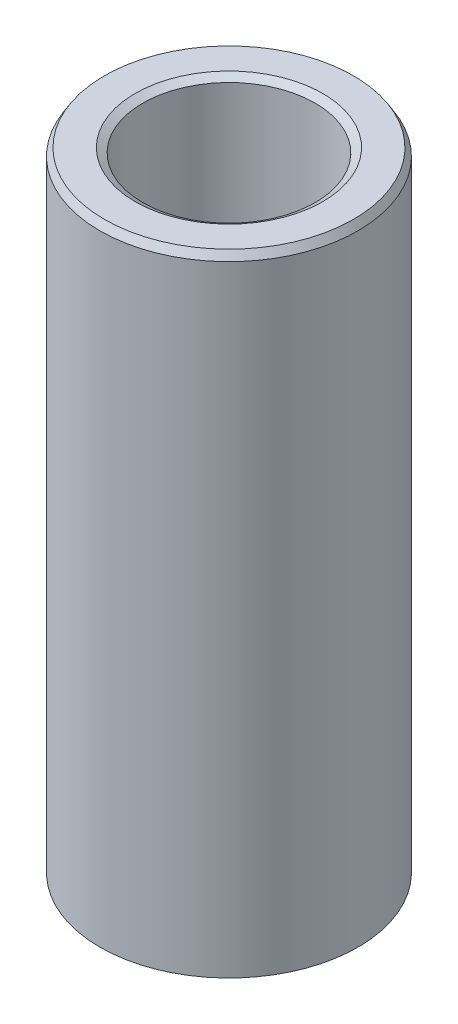
ISO-10303-21;
HEADER;
FILE_DESCRIPTION(('STEP AP214'),'2;1');
FILE_NAME('part.step','',(''),(''),'','','');
FILE_SCHEMA(('AUTOMOTIVE_DESIGN { 1 0 10303 214 1 1 1 1 }'));
ENDSEC;
DATA;
#1=APPLICATION_CONTEXT('core data for automotive mechanical design processes');
#2=APPLICATION_PROTOCOL_DEFINITION('international standard','automotive_design',2000,#1);
#3=PRODUCT_CONTEXT('',#1,'mechanical');
#4=PRODUCT('Part','Part','',(#3));
#5=PRODUCT_RELATED_PRODUCT_CATEGORY('part','',(#4));
#6=PRODUCT_DEFINITION_FORMATION('','',#4);
#7=PRODUCT_DEFINITION_CONTEXT('part definition',#1,'design');
#8=PRODUCT_DEFINITION('design','',#6,#7);
#9=PRODUCT_DEFINITION_SHAPE('','',#8);
#10=(LENGTH_UNIT() NAMED_UNIT(*) SI_UNIT(.MILLI.,.METRE.));
#11=(NAMED_UNIT(*) PLANE_ANGLE_UNIT() SI_UNIT($,.RADIAN.));
#12=(NAMED_UNIT(*) SI_UNIT($,.STERADIAN.) SOLID_ANGLE_UNIT());
#13=UNCERTAINTY_MEASURE_WITH_UNIT(LENGTH_MEASURE(1.E-05),#10,'distance_accuracy_value','');
#14=(GEOMETRIC_REPRESENTATION_CONTEXT(3) GLOBAL_UNCERTAINTY_ASSIGNED_CONTEXT((#13)) GLOBAL_UNIT_ASSIGNED_CONTEXT((#10,
#11,#12)) REPRESENTATION_CONTEXT('',''));
#15=CARTESIAN_POINT('',(0.,0.,0.));
#16=DIRECTION('',(0.,0.,1.));
#17=DIRECTION('',(1.,0.,0.));
#18=AXIS2_PLACEMENT_3D('',#15,#16,#17);
#19=CARTESIAN_POINT('',(0.,294.108973790896,0.));
#20=DIRECTION('',(0.,-1.,0.));
#21=DIRECTION('',(0.,0.,-1.));
#22=AXIS2_PLACEMENT_3D('',#19,#20,#21);
#23=CYLINDRICAL_SURFACE('',#22,60.);
#24=CARTESIAN_POINT('',(0.,2.12950079022189,0.));
#25=DIRECTION('',(0.,1.,0.));
#26=DIRECTION('',(0.,0.,1.));
#27=AXIS2_PLACEMENT_3D('',#24,#25,#26);
#28=CIRCLE('',#27,60.);
#29=CARTESIAN_POINT('',(0.,2.12950079022189,60.));
#30=VERTEX_POINT('',#29);
#31=EDGE_CURVE('E10',#30,#30,#28,.T.);
#32=ORIENTED_EDGE('',*,*,#31,.T.);
#33=EDGE_LOOP('',(#32));
#34=FACE_BOUND('',#33,.T.);
#35=CARTESIAN_POINT('',(0.,290.582787884817,0.));
#36=DIRECTION('',(0.,1.,0.));
#37=DIRECTION('',(0.,0.,1.));
#38=AXIS2_PLACEMENT_3D('',#35,#36,#37);
#39=CIRCLE('',#38,60.);
#40=CARTESIAN_POINT('',(0.,290.582787884817,60.));
#41=VERTEX_POINT('',#40);
#42=EDGE_CURVE('E50',#41,#41,#39,.F.);
#43=ORIENTED_EDGE('',*,*,#42,.T.);
#44=EDGE_LOOP('',(#43));
#45=FACE_BOUND('',#44,.T.);
#46=ADVANCED_FACE('F39',(#34,#45),#23,.T.);
#47=CARTESIAN_POINT('',(0.,294.108973790896,0.));
#48=DIRECTION('',(0.,1.,0.));
#49=DIRECTION('',(0.,0.,1.));
#50=AXIS2_PLACEMENT_3D('',#47,#48,#49);
#51=PLANE('',#50);
#52=CARTESIAN_POINT('',(0.,294.108973790896,0.));
#53=DIRECTION('',(0.,1.,0.));
#54=DIRECTION('',(0.,0.,1.));
#55=AXIS2_PLACEMENT_3D('',#52,#53,#54);
#56=CIRCLE('',#55,43.6024586582773);
#57=CARTESIAN_POINT('',(0.,294.108973790896,43.6024586582773));
#58=VERTEX_POINT('',#57);
#59=EDGE_CURVE('E58',#58,#58,#56,.F.);
#60=ORIENTED_EDGE('',*,*,#59,.T.);
#61=EDGE_LOOP('',(#60));
#62=FACE_BOUND('',#61,.T.);
#63=CARTESIAN_POINT('',(0.,294.108973790896,0.));
#64=DIRECTION('',(0.,1.,0.));
#65=DIRECTION('',(0.,0.,1.));
#66=AXIS2_PLACEMENT_3D('',#63,#64,#65);
#67=CIRCLE('',#66,57.8704992097781);
#68=CARTESIAN_POINT('',(0.,294.108973790896,57.8704992097781));
#69=VERTEX_POINT('',#68);
#70=EDGE_CURVE('E61',#69,#69,#67,.T.);
#71=ORIENTED_EDGE('',*,*,#70,.T.);
#72=EDGE_LOOP('',(#71));
#73=FACE_BOUND('',#72,.T.);
#74=ADVANCED_FACE('F88',(#62,#73),#51,.T.);
#75=CARTESIAN_POINT('',(0.,0.,0.));
#76=DIRECTION('',(0.,1.,0.));
#77=DIRECTION('',(0.,0.,1.));
#78=AXIS2_PLACEMENT_3D('',#75,#76,#77);
#79=PLANE('',#78);
#80=CARTESIAN_POINT('',(0.,0.,0.));
#81=DIRECTION('',(0.,1.,0.));
#82=DIRECTION('',(0.,0.,1.));
#83=AXIS2_PLACEMENT_3D('',#80,#81,#82);
#84=CIRCLE('',#83,42.2057735424206);
#85=CARTESIAN_POINT('',(0.,0.,42.2057735424206));
#86=VERTEX_POINT('',#85);
#87=EDGE_CURVE('E51',#86,#86,#84,.T.);
#88=ORIENTED_EDGE('',*,*,#87,.T.);
#89=EDGE_LOOP('',(#88));
#90=FACE_BOUND('',#89,.T.);
#91=CARTESIAN_POINT('',(0.,0.,0.));
#92=DIRECTION('',(0.,1.,0.));
#93=DIRECTION('',(0.,0.,1.));
#94=AXIS2_PLACEMENT_3D('',#91,#92,#93);
#95=CIRCLE('',#94,56.4738140939214);
#96=CARTESIAN_POINT('',(0.,0.,56.4738140939214));
#97=VERTEX_POINT('',#96);
#98=EDGE_CURVE('E54',#97,#97,#95,.F.);
#99=ORIENTED_EDGE('',*,*,#98,.T.);
#100=EDGE_LOOP('',(#99));
#101=FACE_BOUND('',#100,.T.);
#102=ADVANCED_FACE('F83',(#90,#101),#79,.F.);
#103=CARTESIAN_POINT('',(0.,294.108973790896,0.));
#104=DIRECTION('',(0.,-1.,0.));
#105=DIRECTION('',(0.,0.,-1.));
#106=AXIS2_PLACEMENT_3D('',#103,#104,#105);
#107=CYLINDRICAL_SURFACE('',#106,40.0762727521987);
#108=CARTESIAN_POINT('',(0.,291.979473000674,0.));
#109=DIRECTION('',(0.,1.,0.));
#110=DIRECTION('',(0.,0.,1.));
#111=AXIS2_PLACEMENT_3D('',#108,#109,#110);
#112=CIRCLE('',#111,40.0762727521987);
#113=CARTESIAN_POINT('',(0.,291.979473000674,40.0762727521987));
#114=VERTEX_POINT('',#113);
#115=EDGE_CURVE('E67',#114,#114,#112,.T.);
#116=ORIENTED_EDGE('',*,*,#115,.T.);
#117=EDGE_LOOP('',(#116));
#118=FACE_BOUND('',#117,.T.);
#119=CARTESIAN_POINT('',(0.,3.52618590607867,0.));
#120=DIRECTION('',(0.,1.,0.));
#121=DIRECTION('',(0.,0.,1.));
#122=AXIS2_PLACEMENT_3D('',#119,#120,#121);
#123=CIRCLE('',#122,40.0762727521987);
#124=CARTESIAN_POINT('',(0.,3.52618590607867,40.0762727521987));
#125=VERTEX_POINT('',#124);
#126=EDGE_CURVE('E69',#125,#125,#123,.F.);
#127=ORIENTED_EDGE('',*,*,#126,.T.);
#128=EDGE_LOOP('',(#127));
#129=FACE_BOUND('',#128,.T.);
#130=ADVANCED_FACE('F71',(#118,#129),#107,.F.);
#131=CARTESIAN_POINT('',(0.,291.979473000674,0.));
#132=DIRECTION('',(0.,1.,0.));
#133=DIRECTION('',(0.,0.,1.));
#134=AXIS2_PLACEMENT_3D('',#131,#132,#133);
#135=CONICAL_SURFACE('',#134,40.0762727521987,1.02750639878895);
#136=ORIENTED_EDGE('',*,*,#59,.F.);
#137=EDGE_LOOP('',(#136));
#138=FACE_BOUND('',#137,.T.);
#139=ORIENTED_EDGE('',*,*,#115,.F.);
#140=EDGE_LOOP('',(#139));
#141=FACE_BOUND('',#140,.T.);
#142=ADVANCED_FACE('F77',(#138,#141),#135,.F.);
#143=CARTESIAN_POINT('',(0.,0.,0.));
#144=DIRECTION('',(0.,-1.,0.));
#145=DIRECTION('',(0.,0.,-1.));
#146=AXIS2_PLACEMENT_3D('',#143,#144,#145);
#147=CONICAL_SURFACE('',#146,42.2057735424206,0.543289928005933);
#148=ORIENTED_EDGE('',*,*,#126,.F.);
#149=EDGE_LOOP('',(#148));
#150=FACE_BOUND('',#149,.T.);
#151=ORIENTED_EDGE('',*,*,#87,.F.);
#152=EDGE_LOOP('',(#151));
#153=FACE_BOUND('',#152,.T.);
#154=ADVANCED_FACE('F73',(#150,#153),#147,.F.);
#155=CARTESIAN_POINT('',(0.,2.12950079022189,0.));
#156=DIRECTION('',(0.,1.,0.));
#157=DIRECTION('',(0.,0.,1.));
#158=AXIS2_PLACEMENT_3D('',#155,#156,#157);
#159=CONICAL_SURFACE('',#158,60.,1.02750639878897);
#160=ORIENTED_EDGE('',*,*,#98,.F.);
#161=EDGE_LOOP('',(#160));
#162=FACE_BOUND('',#161,.T.);
#163=ORIENTED_EDGE('',*,*,#31,.F.);
#164=EDGE_LOOP('',(#163));
#165=FACE_BOUND('',#164,.T.);
#166=ADVANCED_FACE('F76',(#162,#165),#159,.T.);
#167=CARTESIAN_POINT('',(0.,294.108973790896,0.));
#168=DIRECTION('',(0.,-1.,0.));
#169=DIRECTION('',(0.,0.,-1.));
#170=AXIS2_PLACEMENT_3D('',#167,#168,#169);
#171=CONICAL_SURFACE('',#170,57.8704992097781,0.543289928005934);
#172=ORIENTED_EDGE('',*,*,#42,.F.);
#173=EDGE_LOOP('',(#172));
#174=FACE_BOUND('',#173,.T.);
#175=ORIENTED_EDGE('',*,*,#70,.F.);
#176=EDGE_LOOP('',(#175));
#177=FACE_BOUND('',#176,.T.);
#178=ADVANCED_FACE('F45',(#174,#177),#171,.T.);
#179=CLOSED_SHELL('',(#46,#74,#102,#130,#142,#154,#166,#178));
#180=MANIFOLD_SOLID_BREP('B2',#179);
#181=ADVANCED_BREP_SHAPE_REPRESENTATION('',(#18,#180),#14);
#182=SHAPE_DEFINITION_REPRESENTATION(#9,#181);
ENDSEC;
END-ISO-10303-21;
